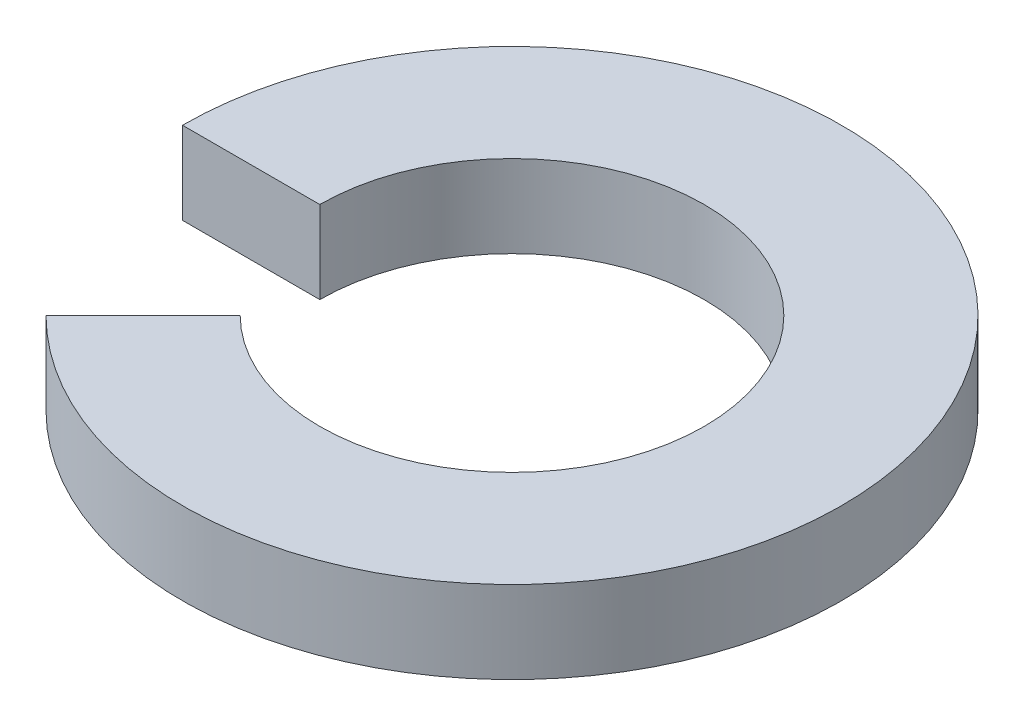
ISO-10303-21;
HEADER;
FILE_DESCRIPTION(('STEP AP214'),'2;1');
FILE_NAME('part.step','',(''),(''),'','','');
FILE_SCHEMA(('AUTOMOTIVE_DESIGN { 1 0 10303 214 1 1 1 1 }'));
ENDSEC;
DATA;
#1=APPLICATION_CONTEXT('core data for automotive mechanical design processes');
#2=APPLICATION_PROTOCOL_DEFINITION('international standard','automotive_design',2000,#1);
#3=PRODUCT_CONTEXT('',#1,'mechanical');
#4=PRODUCT('Part','Part','',(#3));
#5=PRODUCT_RELATED_PRODUCT_CATEGORY('part','',(#4));
#6=PRODUCT_DEFINITION_FORMATION('','',#4);
#7=PRODUCT_DEFINITION_CONTEXT('part definition',#1,'design');
#8=PRODUCT_DEFINITION('design','',#6,#7);
#9=PRODUCT_DEFINITION_SHAPE('','',#8);
#10=(LENGTH_UNIT() NAMED_UNIT(*) SI_UNIT(.MILLI.,.METRE.));
#11=(NAMED_UNIT(*) PLANE_ANGLE_UNIT() SI_UNIT($,.RADIAN.));
#12=(NAMED_UNIT(*) SI_UNIT($,.STERADIAN.) SOLID_ANGLE_UNIT());
#13=UNCERTAINTY_MEASURE_WITH_UNIT(LENGTH_MEASURE(1.E-05),#10,'distance_accuracy_value','');
#14=(GEOMETRIC_REPRESENTATION_CONTEXT(3) GLOBAL_UNCERTAINTY_ASSIGNED_CONTEXT((#13)) GLOBAL_UNIT_ASSIGNED_CONTEXT((#10,
#11,#12)) REPRESENTATION_CONTEXT('',''));
#15=CARTESIAN_POINT('',(0.,0.,0.));
#16=DIRECTION('',(0.,0.,1.));
#17=DIRECTION('',(1.,0.,0.));
#18=AXIS2_PLACEMENT_3D('',#15,#16,#17);
#19=CARTESIAN_POINT('',(0.,1.5,0.));
#20=DIRECTION('',(0.707106781186549,0.,0.707106781186546));
#21=DIRECTION('',(0.707106781186546,0.,-0.707106781186549));
#22=AXIS2_PLACEMENT_3D('',#19,#20,#21);
#23=PLANE('',#22);
#24=DIRECTION('',(-0.707106781186546,0.,0.707106781186549));
#25=VECTOR('',#24,1.);
#26=CARTESIAN_POINT('',(0.,0.,0.));
#27=LINE('',#26,#25);
#28=CARTESIAN_POINT('',(-2.47487373415291,0.,2.47487373415292));
#29=VERTEX_POINT('',#28);
#30=CARTESIAN_POINT('',(-4.24264068711928,0.,4.24264068711929));
#31=VERTEX_POINT('',#30);
#32=EDGE_CURVE('E101',#29,#31,#27,.T.);
#33=ORIENTED_EDGE('',*,*,#32,.T.);
#34=DIRECTION('',(0.,-1.,0.));
#35=VECTOR('',#34,1.);
#36=CARTESIAN_POINT('',(-4.24264068711928,1.5,4.24264068711929));
#37=LINE('',#36,#35);
#38=CARTESIAN_POINT('',(-4.24264068711928,1.5,4.24264068711929));
#39=VERTEX_POINT('',#38);
#40=EDGE_CURVE('E11',#39,#31,#37,.T.);
#41=ORIENTED_EDGE('',*,*,#40,.F.);
#42=DIRECTION('',(-0.707106781186546,0.,0.707106781186549));
#43=VECTOR('',#42,1.);
#44=CARTESIAN_POINT('',(0.,1.5,0.));
#45=LINE('',#44,#43);
#46=CARTESIAN_POINT('',(-2.47487373415291,1.5,2.47487373415292));
#47=VERTEX_POINT('',#46);
#48=EDGE_CURVE('E87',#47,#39,#45,.T.);
#49=ORIENTED_EDGE('',*,*,#48,.F.);
#50=DIRECTION('',(0.,-1.,0.));
#51=VECTOR('',#50,1.);
#52=CARTESIAN_POINT('',(-2.47487373415291,1.5,2.47487373415292));
#53=LINE('',#52,#51);
#54=EDGE_CURVE('E54',#47,#29,#53,.T.);
#55=ORIENTED_EDGE('',*,*,#54,.T.);
#56=EDGE_LOOP('',(#33,#41,#49,#55));
#57=FACE_BOUND('',#56,.T.);
#58=ADVANCED_FACE('F38',(#57),#23,.F.);
#59=CARTESIAN_POINT('',(0.,1.5,0.));
#60=DIRECTION('',(0.,-1.,0.));
#61=DIRECTION('',(0.,0.,-1.));
#62=AXIS2_PLACEMENT_3D('',#59,#60,#61);
#63=CYLINDRICAL_SURFACE('',#62,6.);
#64=CARTESIAN_POINT('',(0.,0.,0.));
#65=DIRECTION('',(0.,1.,0.));
#66=DIRECTION('',(0.,0.,1.));
#67=AXIS2_PLACEMENT_3D('',#64,#65,#66);
#68=CIRCLE('',#67,6.);
#69=CARTESIAN_POINT('',(-6.,0.,0.));
#70=VERTEX_POINT('',#69);
#71=EDGE_CURVE('E92',#31,#70,#68,.T.);
#72=ORIENTED_EDGE('',*,*,#71,.T.);
#73=DIRECTION('',(0.,-1.,0.));
#74=VECTOR('',#73,1.);
#75=CARTESIAN_POINT('',(-6.,1.5,0.));
#76=LINE('',#75,#74);
#77=CARTESIAN_POINT('',(-6.,1.5,0.));
#78=VERTEX_POINT('',#77);
#79=EDGE_CURVE('E46',#78,#70,#76,.T.);
#80=ORIENTED_EDGE('',*,*,#79,.F.);
#81=CARTESIAN_POINT('',(0.,1.5,0.));
#82=DIRECTION('',(0.,1.,0.));
#83=DIRECTION('',(0.,0.,1.));
#84=AXIS2_PLACEMENT_3D('',#81,#82,#83);
#85=CIRCLE('',#84,6.);
#86=EDGE_CURVE('E79',#39,#78,#85,.T.);
#87=ORIENTED_EDGE('',*,*,#86,.F.);
#88=ORIENTED_EDGE('',*,*,#40,.T.);
#89=EDGE_LOOP('',(#72,#80,#87,#88));
#90=FACE_BOUND('',#89,.T.);
#91=ADVANCED_FACE('F91',(#90),#63,.T.);
#92=CARTESIAN_POINT('',(0.,1.5,0.));
#93=DIRECTION('',(0.,0.,1.));
#94=DIRECTION('',(1.,0.,0.));
#95=AXIS2_PLACEMENT_3D('',#92,#93,#94);
#96=PLANE('',#95);
#97=DIRECTION('',(-1.,0.,0.));
#98=VECTOR('',#97,1.);
#99=CARTESIAN_POINT('',(0.,0.,0.));
#100=LINE('',#99,#98);
#101=CARTESIAN_POINT('',(-3.5,0.,0.));
#102=VERTEX_POINT('',#101);
#103=EDGE_CURVE('E104',#102,#70,#100,.T.);
#104=ORIENTED_EDGE('',*,*,#103,.F.);
#105=DIRECTION('',(0.,-1.,0.));
#106=VECTOR('',#105,1.);
#107=CARTESIAN_POINT('',(-3.5,1.5,0.));
#108=LINE('',#107,#106);
#109=CARTESIAN_POINT('',(-3.5,1.5,0.));
#110=VERTEX_POINT('',#109);
#111=EDGE_CURVE('E68',#110,#102,#108,.T.);
#112=ORIENTED_EDGE('',*,*,#111,.F.);
#113=DIRECTION('',(-1.,0.,0.));
#114=VECTOR('',#113,1.);
#115=CARTESIAN_POINT('',(0.,1.5,0.));
#116=LINE('',#115,#114);
#117=EDGE_CURVE('E86',#110,#78,#116,.T.);
#118=ORIENTED_EDGE('',*,*,#117,.T.);
#119=ORIENTED_EDGE('',*,*,#79,.T.);
#120=EDGE_LOOP('',(#104,#112,#118,#119));
#121=FACE_BOUND('',#120,.T.);
#122=ADVANCED_FACE('F95',(#121),#96,.T.);
#123=CARTESIAN_POINT('',(0.,1.5,0.));
#124=DIRECTION('',(0.,-1.,0.));
#125=DIRECTION('',(0.,0.,-1.));
#126=AXIS2_PLACEMENT_3D('',#123,#124,#125);
#127=CYLINDRICAL_SURFACE('',#126,3.5);
#128=CARTESIAN_POINT('',(0.,0.,0.));
#129=DIRECTION('',(0.,1.,0.));
#130=DIRECTION('',(0.,0.,1.));
#131=AXIS2_PLACEMENT_3D('',#128,#129,#130);
#132=CIRCLE('',#131,3.5);
#133=EDGE_CURVE('E106',#29,#102,#132,.T.);
#134=ORIENTED_EDGE('',*,*,#133,.F.);
#135=ORIENTED_EDGE('',*,*,#54,.F.);
#136=CARTESIAN_POINT('',(0.,1.5,0.));
#137=DIRECTION('',(0.,1.,0.));
#138=DIRECTION('',(0.,0.,1.));
#139=AXIS2_PLACEMENT_3D('',#136,#137,#138);
#140=CIRCLE('',#139,3.5);
#141=EDGE_CURVE('E96',#47,#110,#140,.T.);
#142=ORIENTED_EDGE('',*,*,#141,.T.);
#143=ORIENTED_EDGE('',*,*,#111,.T.);
#144=EDGE_LOOP('',(#134,#135,#142,#143));
#145=FACE_BOUND('',#144,.T.);
#146=ADVANCED_FACE('F112',(#145),#127,.F.);
#147=CARTESIAN_POINT('',(0.,1.5,0.));
#148=DIRECTION('',(0.,1.,0.));
#149=DIRECTION('',(0.,0.,1.));
#150=AXIS2_PLACEMENT_3D('',#147,#148,#149);
#151=PLANE('',#150);
#152=ORIENTED_EDGE('',*,*,#48,.T.);
#153=ORIENTED_EDGE('',*,*,#86,.T.);
#154=ORIENTED_EDGE('',*,*,#117,.F.);
#155=ORIENTED_EDGE('',*,*,#141,.F.);
#156=EDGE_LOOP('',(#152,#153,#154,#155));
#157=FACE_BOUND('',#156,.T.);
#158=ADVANCED_FACE('F83',(#157),#151,.T.);
#159=CARTESIAN_POINT('',(0.,0.,0.));
#160=DIRECTION('',(0.,1.,0.));
#161=DIRECTION('',(0.,0.,1.));
#162=AXIS2_PLACEMENT_3D('',#159,#160,#161);
#163=PLANE('',#162);
#164=ORIENTED_EDGE('',*,*,#32,.F.);
#165=ORIENTED_EDGE('',*,*,#133,.T.);
#166=ORIENTED_EDGE('',*,*,#103,.T.);
#167=ORIENTED_EDGE('',*,*,#71,.F.);
#168=EDGE_LOOP('',(#164,#165,#166,#167));
#169=FACE_BOUND('',#168,.T.);
#170=ADVANCED_FACE('F111',(#169),#163,.F.);
#171=CLOSED_SHELL('',(#58,#91,#122,#146,#158,#170));
#172=MANIFOLD_SOLID_BREP('B2',#171);
#173=ADVANCED_BREP_SHAPE_REPRESENTATION('',(#18,#172),#14);
#174=SHAPE_DEFINITION_REPRESENTATION(#9,#173);
ENDSEC;
END-ISO-10303-21;
